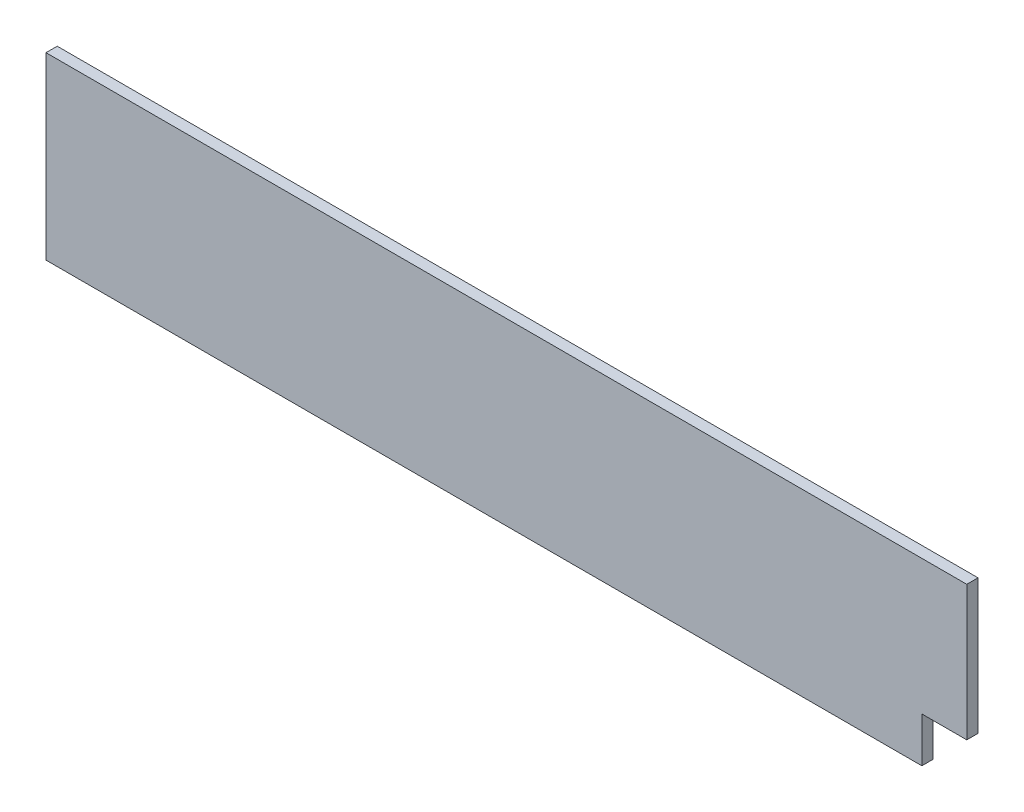
ISO-10303-21;
HEADER;
FILE_DESCRIPTION(('STEP AP214'),'2;1');
FILE_NAME('part.step','',(''),(''),'','','');
FILE_SCHEMA(('AUTOMOTIVE_DESIGN { 1 0 10303 214 1 1 1 1 }'));
ENDSEC;
DATA;
#1=APPLICATION_CONTEXT('core data for automotive mechanical design processes');
#2=APPLICATION_PROTOCOL_DEFINITION('international standard','automotive_design',2000,#1);
#3=PRODUCT_CONTEXT('',#1,'mechanical');
#4=PRODUCT('Part','Part','',(#3));
#5=PRODUCT_RELATED_PRODUCT_CATEGORY('part','',(#4));
#6=PRODUCT_DEFINITION_FORMATION('','',#4);
#7=PRODUCT_DEFINITION_CONTEXT('part definition',#1,'design');
#8=PRODUCT_DEFINITION('design','',#6,#7);
#9=PRODUCT_DEFINITION_SHAPE('','',#8);
#10=(LENGTH_UNIT() NAMED_UNIT(*) SI_UNIT(.MILLI.,.METRE.));
#11=(NAMED_UNIT(*) PLANE_ANGLE_UNIT() SI_UNIT($,.RADIAN.));
#12=(NAMED_UNIT(*) SI_UNIT($,.STERADIAN.) SOLID_ANGLE_UNIT());
#13=UNCERTAINTY_MEASURE_WITH_UNIT(LENGTH_MEASURE(1.E-05),#10,'distance_accuracy_value','');
#14=(GEOMETRIC_REPRESENTATION_CONTEXT(3) GLOBAL_UNCERTAINTY_ASSIGNED_CONTEXT((#13)) GLOBAL_UNIT_ASSIGNED_CONTEXT((#10,
#11,#12)) REPRESENTATION_CONTEXT('',''));
#15=CARTESIAN_POINT('',(0.,0.,0.));
#16=DIRECTION('',(0.,0.,1.));
#17=DIRECTION('',(1.,0.,0.));
#18=AXIS2_PLACEMENT_3D('',#15,#16,#17);
#19=CARTESIAN_POINT('',(0.,0.,25.));
#20=DIRECTION('',(1.,0.,0.));
#21=DIRECTION('',(0.,0.,-1.));
#22=AXIS2_PLACEMENT_3D('',#19,#20,#21);
#23=PLANE('',#22);
#24=DIRECTION('',(0.,-1.,0.));
#25=VECTOR('',#24,1.);
#26=CARTESIAN_POINT('',(0.,0.,0.));
#27=LINE('',#26,#25);
#28=CARTESIAN_POINT('',(0.,400.,0.));
#29=VERTEX_POINT('',#28);
#30=CARTESIAN_POINT('',(0.,0.,0.));
#31=VERTEX_POINT('',#30);
#32=EDGE_CURVE('E123',#29,#31,#27,.T.);
#33=ORIENTED_EDGE('',*,*,#32,.T.);
#34=DIRECTION('',(0.,0.,-1.));
#35=VECTOR('',#34,1.);
#36=CARTESIAN_POINT('',(0.,0.,25.));
#37=LINE('',#36,#35);
#38=CARTESIAN_POINT('',(0.,0.,25.));
#39=VERTEX_POINT('',#38);
#40=EDGE_CURVE('E11',#39,#31,#37,.T.);
#41=ORIENTED_EDGE('',*,*,#40,.F.);
#42=DIRECTION('',(0.,-1.,0.));
#43=VECTOR('',#42,1.);
#44=CARTESIAN_POINT('',(0.,0.,25.));
#45=LINE('',#44,#43);
#46=CARTESIAN_POINT('',(0.,400.,25.));
#47=VERTEX_POINT('',#46);
#48=EDGE_CURVE('E120',#47,#39,#45,.T.);
#49=ORIENTED_EDGE('',*,*,#48,.F.);
#50=DIRECTION('',(0.,0.,-1.));
#51=VECTOR('',#50,1.);
#52=CARTESIAN_POINT('',(0.,400.,25.));
#53=LINE('',#52,#51);
#54=EDGE_CURVE('E127',#47,#29,#53,.T.);
#55=ORIENTED_EDGE('',*,*,#54,.T.);
#56=EDGE_LOOP('',(#33,#41,#49,#55));
#57=FACE_BOUND('',#56,.T.);
#58=ADVANCED_FACE('F37',(#57),#23,.F.);
#59=CARTESIAN_POINT('',(0.,0.,25.));
#60=DIRECTION('',(0.,1.,0.));
#61=DIRECTION('',(0.,0.,1.));
#62=AXIS2_PLACEMENT_3D('',#59,#60,#61);
#63=PLANE('',#62);
#64=DIRECTION('',(1.,0.,0.));
#65=VECTOR('',#64,1.);
#66=CARTESIAN_POINT('',(0.,0.,0.));
#67=LINE('',#66,#65);
#68=CARTESIAN_POINT('',(1950.,0.,0.));
#69=VERTEX_POINT('',#68);
#70=EDGE_CURVE('E118',#31,#69,#67,.T.);
#71=ORIENTED_EDGE('',*,*,#70,.T.);
#72=DIRECTION('',(0.,0.,1.));
#73=VECTOR('',#72,1.);
#74=CARTESIAN_POINT('',(1950.,0.,0.));
#75=LINE('',#74,#73);
#76=CARTESIAN_POINT('',(1950.,0.,25.));
#77=VERTEX_POINT('',#76);
#78=EDGE_CURVE('E134',#69,#77,#75,.T.);
#79=ORIENTED_EDGE('',*,*,#78,.T.);
#80=DIRECTION('',(1.,0.,0.));
#81=VECTOR('',#80,1.);
#82=CARTESIAN_POINT('',(0.,0.,25.));
#83=LINE('',#82,#81);
#84=EDGE_CURVE('E83',#39,#77,#83,.T.);
#85=ORIENTED_EDGE('',*,*,#84,.F.);
#86=ORIENTED_EDGE('',*,*,#40,.T.);
#87=EDGE_LOOP('',(#71,#79,#85,#86));
#88=FACE_BOUND('',#87,.T.);
#89=ADVANCED_FACE('F144',(#88),#63,.F.);
#90=CARTESIAN_POINT('',(2050.,0.,25.));
#91=DIRECTION('',(-1.,0.,0.));
#92=DIRECTION('',(0.,0.,1.));
#93=AXIS2_PLACEMENT_3D('',#90,#91,#92);
#94=PLANE('',#93);
#95=DIRECTION('',(0.,1.,0.));
#96=VECTOR('',#95,1.);
#97=CARTESIAN_POINT('',(2050.,0.,25.));
#98=LINE('',#97,#96);
#99=CARTESIAN_POINT('',(2050.,100.,25.));
#100=VERTEX_POINT('',#99);
#101=CARTESIAN_POINT('',(2050.,400.,25.));
#102=VERTEX_POINT('',#101);
#103=EDGE_CURVE('E114',#100,#102,#98,.T.);
#104=ORIENTED_EDGE('',*,*,#103,.F.);
#105=DIRECTION('',(0.,0.,1.));
#106=VECTOR('',#105,1.);
#107=CARTESIAN_POINT('',(2050.,100.,0.));
#108=LINE('',#107,#106);
#109=CARTESIAN_POINT('',(2050.,100.,0.));
#110=VERTEX_POINT('',#109);
#111=EDGE_CURVE('E102',#110,#100,#108,.T.);
#112=ORIENTED_EDGE('',*,*,#111,.F.);
#113=DIRECTION('',(0.,1.,0.));
#114=VECTOR('',#113,1.);
#115=CARTESIAN_POINT('',(2050.,0.,0.));
#116=LINE('',#115,#114);
#117=CARTESIAN_POINT('',(2050.,400.,0.));
#118=VERTEX_POINT('',#117);
#119=EDGE_CURVE('E113',#110,#118,#116,.T.);
#120=ORIENTED_EDGE('',*,*,#119,.T.);
#121=DIRECTION('',(0.,0.,-1.));
#122=VECTOR('',#121,1.);
#123=CARTESIAN_POINT('',(2050.,400.,25.));
#124=LINE('',#123,#122);
#125=EDGE_CURVE('E44',#102,#118,#124,.T.);
#126=ORIENTED_EDGE('',*,*,#125,.F.);
#127=EDGE_LOOP('',(#104,#112,#120,#126));
#128=FACE_BOUND('',#127,.T.);
#129=ADVANCED_FACE('F111',(#128),#94,.F.);
#130=CARTESIAN_POINT('',(0.,400.,25.));
#131=DIRECTION('',(0.,-1.,0.));
#132=DIRECTION('',(0.,0.,-1.));
#133=AXIS2_PLACEMENT_3D('',#130,#131,#132);
#134=PLANE('',#133);
#135=DIRECTION('',(-1.,0.,0.));
#136=VECTOR('',#135,1.);
#137=CARTESIAN_POINT('',(0.,400.,0.));
#138=LINE('',#137,#136);
#139=EDGE_CURVE('E77',#118,#29,#138,.T.);
#140=ORIENTED_EDGE('',*,*,#139,.T.);
#141=ORIENTED_EDGE('',*,*,#54,.F.);
#142=DIRECTION('',(-1.,0.,0.));
#143=VECTOR('',#142,1.);
#144=CARTESIAN_POINT('',(0.,400.,25.));
#145=LINE('',#144,#143);
#146=EDGE_CURVE('E60',#102,#47,#145,.T.);
#147=ORIENTED_EDGE('',*,*,#146,.F.);
#148=ORIENTED_EDGE('',*,*,#125,.T.);
#149=EDGE_LOOP('',(#140,#141,#147,#148));
#150=FACE_BOUND('',#149,.T.);
#151=ADVANCED_FACE('F128',(#150),#134,.F.);
#152=CARTESIAN_POINT('',(0.,0.,25.));
#153=DIRECTION('',(0.,0.,-1.));
#154=DIRECTION('',(-1.,0.,0.));
#155=AXIS2_PLACEMENT_3D('',#152,#153,#154);
#156=PLANE('',#155);
#157=ORIENTED_EDGE('',*,*,#84,.T.);
#158=DIRECTION('',(0.,-1.,0.));
#159=VECTOR('',#158,1.);
#160=CARTESIAN_POINT('',(1950.,0.,25.));
#161=LINE('',#160,#159);
#162=CARTESIAN_POINT('',(1950.,100.,25.));
#163=VERTEX_POINT('',#162);
#164=EDGE_CURVE('E107',#163,#77,#161,.T.);
#165=ORIENTED_EDGE('',*,*,#164,.F.);
#166=DIRECTION('',(-1.,0.,0.));
#167=VECTOR('',#166,1.);
#168=CARTESIAN_POINT('',(2050.,100.,25.));
#169=LINE('',#168,#167);
#170=EDGE_CURVE('E146',#100,#163,#169,.T.);
#171=ORIENTED_EDGE('',*,*,#170,.F.);
#172=ORIENTED_EDGE('',*,*,#103,.T.);
#173=ORIENTED_EDGE('',*,*,#146,.T.);
#174=ORIENTED_EDGE('',*,*,#48,.T.);
#175=EDGE_LOOP('',(#157,#165,#171,#172,#173,#174));
#176=FACE_BOUND('',#175,.T.);
#177=ADVANCED_FACE('F143',(#176),#156,.F.);
#178=CARTESIAN_POINT('',(0.,0.,0.));
#179=DIRECTION('',(0.,0.,-1.));
#180=DIRECTION('',(-1.,0.,0.));
#181=AXIS2_PLACEMENT_3D('',#178,#179,#180);
#182=PLANE('',#181);
#183=DIRECTION('',(0.,-1.,0.));
#184=VECTOR('',#183,1.);
#185=CARTESIAN_POINT('',(1950.,0.,0.));
#186=LINE('',#185,#184);
#187=CARTESIAN_POINT('',(1950.,100.,0.));
#188=VERTEX_POINT('',#187);
#189=EDGE_CURVE('E51',#188,#69,#186,.T.);
#190=ORIENTED_EDGE('',*,*,#189,.T.);
#191=ORIENTED_EDGE('',*,*,#70,.F.);
#192=ORIENTED_EDGE('',*,*,#32,.F.);
#193=ORIENTED_EDGE('',*,*,#139,.F.);
#194=ORIENTED_EDGE('',*,*,#119,.F.);
#195=DIRECTION('',(-1.,0.,0.));
#196=VECTOR('',#195,1.);
#197=CARTESIAN_POINT('',(2050.,100.,0.));
#198=LINE('',#197,#196);
#199=EDGE_CURVE('E98',#110,#188,#198,.T.);
#200=ORIENTED_EDGE('',*,*,#199,.T.);
#201=EDGE_LOOP('',(#190,#191,#192,#193,#194,#200));
#202=FACE_BOUND('',#201,.T.);
#203=ADVANCED_FACE('F116',(#202),#182,.T.);
#204=CARTESIAN_POINT('',(1950.,0.,0.));
#205=DIRECTION('',(-1.,0.,0.));
#206=DIRECTION('',(0.,0.,1.));
#207=AXIS2_PLACEMENT_3D('',#204,#205,#206);
#208=PLANE('',#207);
#209=ORIENTED_EDGE('',*,*,#164,.T.);
#210=ORIENTED_EDGE('',*,*,#78,.F.);
#211=ORIENTED_EDGE('',*,*,#189,.F.);
#212=DIRECTION('',(0.,0.,1.));
#213=VECTOR('',#212,1.);
#214=CARTESIAN_POINT('',(1950.,100.,0.));
#215=LINE('',#214,#213);
#216=EDGE_CURVE('E104',#188,#163,#215,.T.);
#217=ORIENTED_EDGE('',*,*,#216,.T.);
#218=EDGE_LOOP('',(#209,#210,#211,#217));
#219=FACE_BOUND('',#218,.T.);
#220=ADVANCED_FACE('F147',(#219),#208,.F.);
#221=CARTESIAN_POINT('',(2050.,100.,0.));
#222=DIRECTION('',(0.,1.,0.));
#223=DIRECTION('',(-1.,0.,0.));
#224=AXIS2_PLACEMENT_3D('',#221,#222,#223);
#225=PLANE('',#224);
#226=ORIENTED_EDGE('',*,*,#170,.T.);
#227=ORIENTED_EDGE('',*,*,#216,.F.);
#228=ORIENTED_EDGE('',*,*,#199,.F.);
#229=ORIENTED_EDGE('',*,*,#111,.T.);
#230=EDGE_LOOP('',(#226,#227,#228,#229));
#231=FACE_BOUND('',#230,.T.);
#232=ADVANCED_FACE('F101',(#231),#225,.F.);
#233=CLOSED_SHELL('',(#58,#89,#129,#151,#177,#203,#220,#232));
#234=MANIFOLD_SOLID_BREP('B2',#233);
#235=ADVANCED_BREP_SHAPE_REPRESENTATION('',(#18,#234),#14);
#236=SHAPE_DEFINITION_REPRESENTATION(#9,#235);
ENDSEC;
END-ISO-10303-21;
